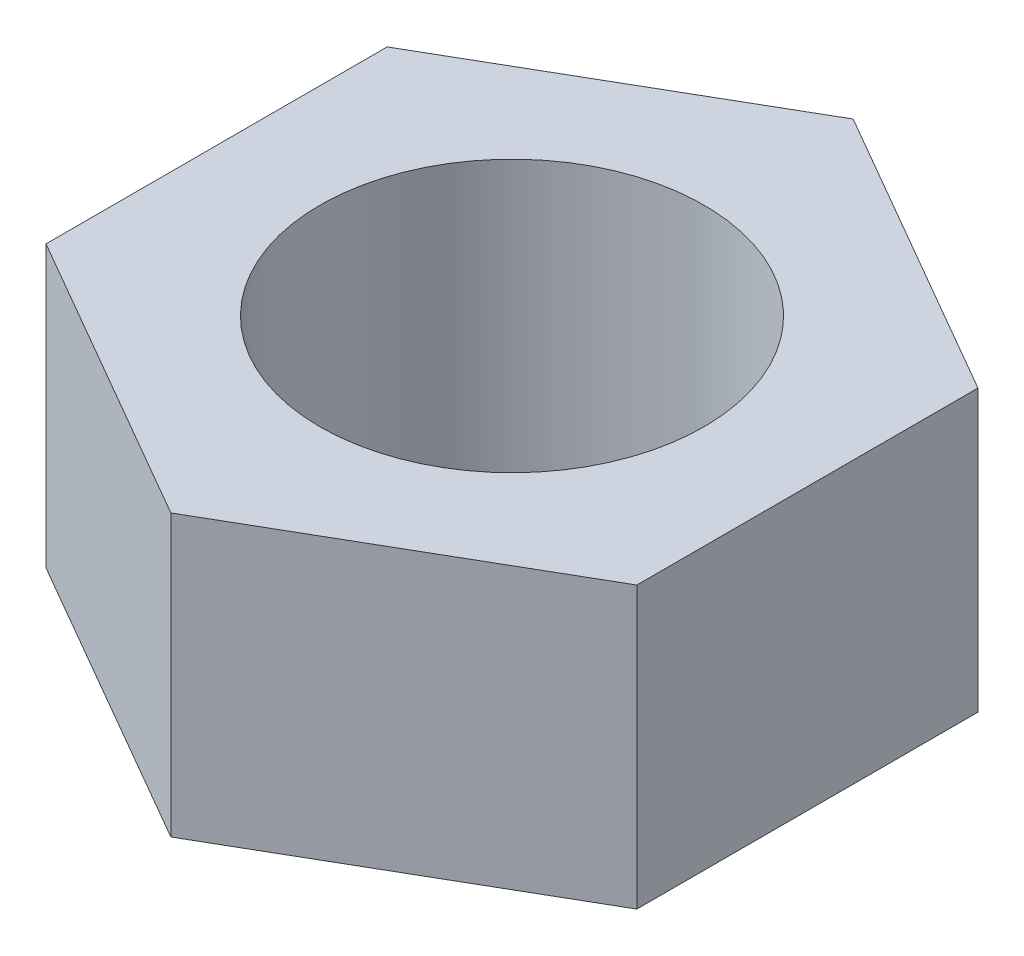
ISO-10303-21;
HEADER;
FILE_DESCRIPTION(('STEP AP214'),'2;1');
FILE_NAME('part.step','',(''),(''),'','','');
FILE_SCHEMA(('AUTOMOTIVE_DESIGN { 1 0 10303 214 1 1 1 1 }'));
ENDSEC;
DATA;
#1=APPLICATION_CONTEXT('core data for automotive mechanical design processes');
#2=APPLICATION_PROTOCOL_DEFINITION('international standard','automotive_design',2000,#1);
#3=PRODUCT_CONTEXT('',#1,'mechanical');
#4=PRODUCT('Part','Part','',(#3));
#5=PRODUCT_RELATED_PRODUCT_CATEGORY('part','',(#4));
#6=PRODUCT_DEFINITION_FORMATION('','',#4);
#7=PRODUCT_DEFINITION_CONTEXT('part definition',#1,'design');
#8=PRODUCT_DEFINITION('design','',#6,#7);
#9=PRODUCT_DEFINITION_SHAPE('','',#8);
#10=(LENGTH_UNIT() NAMED_UNIT(*) SI_UNIT(.MILLI.,.METRE.));
#11=(NAMED_UNIT(*) PLANE_ANGLE_UNIT() SI_UNIT($,.RADIAN.));
#12=(NAMED_UNIT(*) SI_UNIT($,.STERADIAN.) SOLID_ANGLE_UNIT());
#13=UNCERTAINTY_MEASURE_WITH_UNIT(LENGTH_MEASURE(1.E-05),#10,'distance_accuracy_value','');
#14=(GEOMETRIC_REPRESENTATION_CONTEXT(3) GLOBAL_UNCERTAINTY_ASSIGNED_CONTEXT((#13)) GLOBAL_UNIT_ASSIGNED_CONTEXT((#10,
#11,#12)) REPRESENTATION_CONTEXT('',''));
#15=CARTESIAN_POINT('',(0.,0.,0.));
#16=DIRECTION('',(0.,0.,1.));
#17=DIRECTION('',(1.,0.,0.));
#18=AXIS2_PLACEMENT_3D('',#15,#16,#17);
#19=CARTESIAN_POINT('',(0.,3.8,0.));
#20=DIRECTION('',(0.,1.,0.));
#21=DIRECTION('',(0.,0.,1.));
#22=AXIS2_PLACEMENT_3D('',#19,#20,#21);
#23=PLANE('',#22);
#24=DIRECTION('',(0.866025403784439,0.,-0.5));
#25=VECTOR('',#24,1.);
#26=CARTESIAN_POINT('',(0.,3.8,4.61880215351701));
#27=LINE('',#26,#25);
#28=CARTESIAN_POINT('',(0.,3.8,4.61880215351701));
#29=VERTEX_POINT('',#28);
#30=CARTESIAN_POINT('',(4.,3.8,2.30940107675851));
#31=VERTEX_POINT('',#30);
#32=EDGE_CURVE('E130',#29,#31,#27,.T.);
#33=ORIENTED_EDGE('',*,*,#32,.T.);
#34=DIRECTION('',(0.,0.,-1.));
#35=VECTOR('',#34,1.);
#36=CARTESIAN_POINT('',(4.,3.8,2.30940107675851));
#37=LINE('',#36,#35);
#38=CARTESIAN_POINT('',(4.,3.8,-2.30940107675851));
#39=VERTEX_POINT('',#38);
#40=EDGE_CURVE('E88',#31,#39,#37,.T.);
#41=ORIENTED_EDGE('',*,*,#40,.T.);
#42=DIRECTION('',(-0.866025403784439,0.,-0.5));
#43=VECTOR('',#42,1.);
#44=CARTESIAN_POINT('',(4.,3.8,-2.30940107675851));
#45=LINE('',#44,#43);
#46=CARTESIAN_POINT('',(0.,3.8,-4.61880215351701));
#47=VERTEX_POINT('',#46);
#48=EDGE_CURVE('E101',#39,#47,#45,.T.);
#49=ORIENTED_EDGE('',*,*,#48,.T.);
#50=DIRECTION('',(-0.866025403784439,0.,0.5));
#51=VECTOR('',#50,1.);
#52=CARTESIAN_POINT('',(0.,3.8,-4.61880215351701));
#53=LINE('',#52,#51);
#54=CARTESIAN_POINT('',(-4.,3.8,-2.3094010767585));
#55=VERTEX_POINT('',#54);
#56=EDGE_CURVE('E95',#47,#55,#53,.T.);
#57=ORIENTED_EDGE('',*,*,#56,.T.);
#58=DIRECTION('',(0.,0.,1.));
#59=VECTOR('',#58,1.);
#60=CARTESIAN_POINT('',(-4.,3.8,-2.3094010767585));
#61=LINE('',#60,#59);
#62=CARTESIAN_POINT('',(-4.,3.8,2.3094010767585));
#63=VERTEX_POINT('',#62);
#64=EDGE_CURVE('E99',#55,#63,#61,.T.);
#65=ORIENTED_EDGE('',*,*,#64,.T.);
#66=DIRECTION('',(0.866025403784439,0.,0.5));
#67=VECTOR('',#66,1.);
#68=CARTESIAN_POINT('',(-4.,3.8,2.3094010767585));
#69=LINE('',#68,#67);
#70=EDGE_CURVE('E51',#63,#29,#69,.T.);
#71=ORIENTED_EDGE('',*,*,#70,.T.);
#72=EDGE_LOOP('',(#33,#41,#49,#57,#65,#71));
#73=FACE_BOUND('',#72,.T.);
#74=CARTESIAN_POINT('',(0.,3.8,0.));
#75=DIRECTION('',(0.,1.,0.));
#76=DIRECTION('',(0.,0.,1.));
#77=AXIS2_PLACEMENT_3D('',#74,#75,#76);
#78=CIRCLE('',#77,2.6);
#79=CARTESIAN_POINT('',(0.,3.8,2.6));
#80=VERTEX_POINT('',#79);
#81=EDGE_CURVE('E123',#80,#80,#78,.T.);
#82=ORIENTED_EDGE('',*,*,#81,.F.);
#83=EDGE_LOOP('',(#82));
#84=FACE_BOUND('',#83,.T.);
#85=ADVANCED_FACE('F34',(#73,#84),#23,.T.);
#86=CARTESIAN_POINT('',(0.,0.,0.));
#87=DIRECTION('',(0.,1.,0.));
#88=DIRECTION('',(0.,0.,1.));
#89=AXIS2_PLACEMENT_3D('',#86,#87,#88);
#90=PLANE('',#89);
#91=DIRECTION('',(0.866025403784439,0.,-0.5));
#92=VECTOR('',#91,1.);
#93=CARTESIAN_POINT('',(0.,0.,4.61880215351701));
#94=LINE('',#93,#92);
#95=CARTESIAN_POINT('',(0.,0.,4.61880215351701));
#96=VERTEX_POINT('',#95);
#97=CARTESIAN_POINT('',(4.,0.,2.30940107675851));
#98=VERTEX_POINT('',#97);
#99=EDGE_CURVE('E119',#96,#98,#94,.T.);
#100=ORIENTED_EDGE('',*,*,#99,.F.);
#101=DIRECTION('',(0.866025403784439,0.,0.5));
#102=VECTOR('',#101,1.);
#103=CARTESIAN_POINT('',(-4.,0.,2.3094010767585));
#104=LINE('',#103,#102);
#105=CARTESIAN_POINT('',(-4.,0.,2.3094010767585));
#106=VERTEX_POINT('',#105);
#107=EDGE_CURVE('E80',#106,#96,#104,.T.);
#108=ORIENTED_EDGE('',*,*,#107,.F.);
#109=DIRECTION('',(0.,0.,1.));
#110=VECTOR('',#109,1.);
#111=CARTESIAN_POINT('',(-4.,0.,-2.3094010767585));
#112=LINE('',#111,#110);
#113=CARTESIAN_POINT('',(-4.,0.,-2.3094010767585));
#114=VERTEX_POINT('',#113);
#115=EDGE_CURVE('E74',#114,#106,#112,.T.);
#116=ORIENTED_EDGE('',*,*,#115,.F.);
#117=DIRECTION('',(-0.866025403784439,0.,0.5));
#118=VECTOR('',#117,1.);
#119=CARTESIAN_POINT('',(0.,0.,-4.61880215351701));
#120=LINE('',#119,#118);
#121=CARTESIAN_POINT('',(0.,0.,-4.61880215351701));
#122=VERTEX_POINT('',#121);
#123=EDGE_CURVE('E109',#122,#114,#120,.T.);
#124=ORIENTED_EDGE('',*,*,#123,.F.);
#125=DIRECTION('',(-0.866025403784439,0.,-0.5));
#126=VECTOR('',#125,1.);
#127=CARTESIAN_POINT('',(4.,0.,-2.30940107675851));
#128=LINE('',#127,#126);
#129=CARTESIAN_POINT('',(4.,0.,-2.30940107675851));
#130=VERTEX_POINT('',#129);
#131=EDGE_CURVE('E125',#130,#122,#128,.T.);
#132=ORIENTED_EDGE('',*,*,#131,.F.);
#133=DIRECTION('',(0.,0.,-1.));
#134=VECTOR('',#133,1.);
#135=CARTESIAN_POINT('',(4.,0.,2.30940107675851));
#136=LINE('',#135,#134);
#137=EDGE_CURVE('E122',#98,#130,#136,.T.);
#138=ORIENTED_EDGE('',*,*,#137,.F.);
#139=EDGE_LOOP('',(#100,#108,#116,#124,#132,#138));
#140=FACE_BOUND('',#139,.T.);
#141=CARTESIAN_POINT('',(0.,0.,0.));
#142=DIRECTION('',(0.,1.,0.));
#143=DIRECTION('',(0.,0.,1.));
#144=AXIS2_PLACEMENT_3D('',#141,#142,#143);
#145=CIRCLE('',#144,2.6);
#146=CARTESIAN_POINT('',(0.,0.,2.6));
#147=VERTEX_POINT('',#146);
#148=EDGE_CURVE('E223',#147,#147,#145,.T.);
#149=ORIENTED_EDGE('',*,*,#148,.T.);
#150=EDGE_LOOP('',(#149));
#151=FACE_BOUND('',#150,.T.);
#152=ADVANCED_FACE('F139',(#140,#151),#90,.F.);
#153=CARTESIAN_POINT('',(0.,3.8,4.61880215351701));
#154=DIRECTION('',(-0.5,0.,-0.866025403784439));
#155=DIRECTION('',(-0.866025403784439,0.,0.5));
#156=AXIS2_PLACEMENT_3D('',#153,#154,#155);
#157=PLANE('',#156);
#158=ORIENTED_EDGE('',*,*,#99,.T.);
#159=DIRECTION('',(0.,-1.,0.));
#160=VECTOR('',#159,1.);
#161=CARTESIAN_POINT('',(4.,3.8,2.30940107675851));
#162=LINE('',#161,#160);
#163=EDGE_CURVE('E11',#31,#98,#162,.T.);
#164=ORIENTED_EDGE('',*,*,#163,.F.);
#165=ORIENTED_EDGE('',*,*,#32,.F.);
#166=DIRECTION('',(0.,-1.,0.));
#167=VECTOR('',#166,1.);
#168=CARTESIAN_POINT('',(0.,3.8,4.61880215351701));
#169=LINE('',#168,#167);
#170=EDGE_CURVE('E115',#29,#96,#169,.T.);
#171=ORIENTED_EDGE('',*,*,#170,.T.);
#172=EDGE_LOOP('',(#158,#164,#165,#171));
#173=FACE_BOUND('',#172,.T.);
#174=ADVANCED_FACE('F36',(#173),#157,.F.);
#175=CARTESIAN_POINT('',(4.,3.8,2.30940107675851));
#176=DIRECTION('',(-1.,0.,0.));
#177=DIRECTION('',(0.,0.,1.));
#178=AXIS2_PLACEMENT_3D('',#175,#176,#177);
#179=PLANE('',#178);
#180=ORIENTED_EDGE('',*,*,#137,.T.);
#181=DIRECTION('',(0.,-1.,0.));
#182=VECTOR('',#181,1.);
#183=CARTESIAN_POINT('',(4.,3.8,-2.30940107675851));
#184=LINE('',#183,#182);
#185=EDGE_CURVE('E43',#39,#130,#184,.T.);
#186=ORIENTED_EDGE('',*,*,#185,.F.);
#187=ORIENTED_EDGE('',*,*,#40,.F.);
#188=ORIENTED_EDGE('',*,*,#163,.T.);
#189=EDGE_LOOP('',(#180,#186,#187,#188));
#190=FACE_BOUND('',#189,.T.);
#191=ADVANCED_FACE('F164',(#190),#179,.F.);
#192=CARTESIAN_POINT('',(4.,3.8,-2.30940107675851));
#193=DIRECTION('',(-0.5,0.,0.866025403784439));
#194=DIRECTION('',(0.866025403784439,0.,0.5));
#195=AXIS2_PLACEMENT_3D('',#192,#193,#194);
#196=PLANE('',#195);
#197=ORIENTED_EDGE('',*,*,#131,.T.);
#198=DIRECTION('',(0.,-1.,0.));
#199=VECTOR('',#198,1.);
#200=CARTESIAN_POINT('',(0.,3.8,-4.61880215351701));
#201=LINE('',#200,#199);
#202=EDGE_CURVE('E110',#47,#122,#201,.T.);
#203=ORIENTED_EDGE('',*,*,#202,.F.);
#204=ORIENTED_EDGE('',*,*,#48,.F.);
#205=ORIENTED_EDGE('',*,*,#185,.T.);
#206=EDGE_LOOP('',(#197,#203,#204,#205));
#207=FACE_BOUND('',#206,.T.);
#208=ADVANCED_FACE('F136',(#207),#196,.F.);
#209=CARTESIAN_POINT('',(0.,3.8,-4.61880215351701));
#210=DIRECTION('',(0.5,0.,0.866025403784439));
#211=DIRECTION('',(0.866025403784439,0.,-0.5));
#212=AXIS2_PLACEMENT_3D('',#209,#210,#211);
#213=PLANE('',#212);
#214=ORIENTED_EDGE('',*,*,#123,.T.);
#215=DIRECTION('',(0.,-1.,0.));
#216=VECTOR('',#215,1.);
#217=CARTESIAN_POINT('',(-4.,3.8,-2.3094010767585));
#218=LINE('',#217,#216);
#219=EDGE_CURVE('E106',#55,#114,#218,.T.);
#220=ORIENTED_EDGE('',*,*,#219,.F.);
#221=ORIENTED_EDGE('',*,*,#56,.F.);
#222=ORIENTED_EDGE('',*,*,#202,.T.);
#223=EDGE_LOOP('',(#214,#220,#221,#222));
#224=FACE_BOUND('',#223,.T.);
#225=ADVANCED_FACE('F107',(#224),#213,.F.);
#226=CARTESIAN_POINT('',(-4.,3.8,-2.3094010767585));
#227=DIRECTION('',(1.,0.,0.));
#228=DIRECTION('',(0.,0.,-1.));
#229=AXIS2_PLACEMENT_3D('',#226,#227,#228);
#230=PLANE('',#229);
#231=ORIENTED_EDGE('',*,*,#115,.T.);
#232=DIRECTION('',(0.,-1.,0.));
#233=VECTOR('',#232,1.);
#234=CARTESIAN_POINT('',(-4.,3.8,2.3094010767585));
#235=LINE('',#234,#233);
#236=EDGE_CURVE('E111',#63,#106,#235,.T.);
#237=ORIENTED_EDGE('',*,*,#236,.F.);
#238=ORIENTED_EDGE('',*,*,#64,.F.);
#239=ORIENTED_EDGE('',*,*,#219,.T.);
#240=EDGE_LOOP('',(#231,#237,#238,#239));
#241=FACE_BOUND('',#240,.T.);
#242=ADVANCED_FACE('F113',(#241),#230,.F.);
#243=CARTESIAN_POINT('',(-4.,3.8,2.3094010767585));
#244=DIRECTION('',(0.5,0.,-0.866025403784439));
#245=DIRECTION('',(-0.866025403784439,0.,-0.5));
#246=AXIS2_PLACEMENT_3D('',#243,#244,#245);
#247=PLANE('',#246);
#248=ORIENTED_EDGE('',*,*,#107,.T.);
#249=ORIENTED_EDGE('',*,*,#170,.F.);
#250=ORIENTED_EDGE('',*,*,#70,.F.);
#251=ORIENTED_EDGE('',*,*,#236,.T.);
#252=EDGE_LOOP('',(#248,#249,#250,#251));
#253=FACE_BOUND('',#252,.T.);
#254=ADVANCED_FACE('F144',(#253),#247,.F.);
#255=CARTESIAN_POINT('',(0.,3.8,0.));
#256=DIRECTION('',(0.,-1.,0.));
#257=DIRECTION('',(0.,0.,-1.));
#258=AXIS2_PLACEMENT_3D('',#255,#256,#257);
#259=CYLINDRICAL_SURFACE('',#258,2.6);
#260=ORIENTED_EDGE('',*,*,#81,.T.);
#261=EDGE_LOOP('',(#260));
#262=FACE_BOUND('',#261,.T.);
#263=ORIENTED_EDGE('',*,*,#148,.F.);
#264=EDGE_LOOP('',(#263));
#265=FACE_BOUND('',#264,.T.);
#266=ADVANCED_FACE('F146',(#262,#265),#259,.F.);
#267=CLOSED_SHELL('',(#85,#152,#174,#191,#208,#225,#242,#254,#266));
#268=MANIFOLD_SOLID_BREP('B2',#267);
#269=ADVANCED_BREP_SHAPE_REPRESENTATION('',(#18,#268),#14);
#270=SHAPE_DEFINITION_REPRESENTATION(#9,#269);
ENDSEC;
END-ISO-10303-21;
